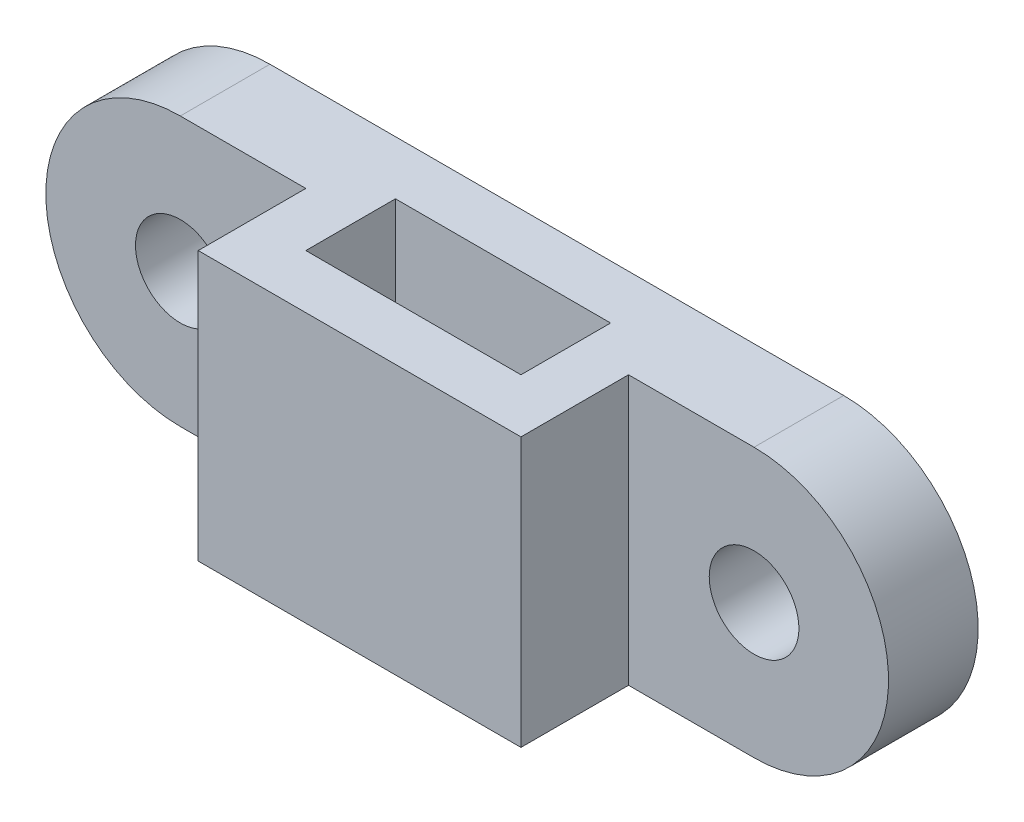
ISO-10303-21;
HEADER;
FILE_DESCRIPTION(('STEP AP214'),'2;1');
FILE_NAME('part.step','',(''),(''),'','','');
FILE_SCHEMA(('AUTOMOTIVE_DESIGN { 1 0 10303 214 1 1 1 1 }'));
ENDSEC;
DATA;
#1=APPLICATION_CONTEXT('core data for automotive mechanical design processes');
#2=APPLICATION_PROTOCOL_DEFINITION('international standard','automotive_design',2000,#1);
#3=PRODUCT_CONTEXT('',#1,'mechanical');
#4=PRODUCT('Part','Part','',(#3));
#5=PRODUCT_RELATED_PRODUCT_CATEGORY('part','',(#4));
#6=PRODUCT_DEFINITION_FORMATION('','',#4);
#7=PRODUCT_DEFINITION_CONTEXT('part definition',#1,'design');
#8=PRODUCT_DEFINITION('design','',#6,#7);
#9=PRODUCT_DEFINITION_SHAPE('','',#8);
#10=(LENGTH_UNIT() NAMED_UNIT(*) SI_UNIT(.MILLI.,.METRE.));
#11=(NAMED_UNIT(*) PLANE_ANGLE_UNIT() SI_UNIT($,.RADIAN.));
#12=(NAMED_UNIT(*) SI_UNIT($,.STERADIAN.) SOLID_ANGLE_UNIT());
#13=UNCERTAINTY_MEASURE_WITH_UNIT(LENGTH_MEASURE(1.E-05),#10,'distance_accuracy_value','');
#14=(GEOMETRIC_REPRESENTATION_CONTEXT(3) GLOBAL_UNCERTAINTY_ASSIGNED_CONTEXT((#13)) GLOBAL_UNIT_ASSIGNED_CONTEXT((#10,
#11,#12)) REPRESENTATION_CONTEXT('',''));
#15=CARTESIAN_POINT('',(0.,0.,0.));
#16=DIRECTION('',(0.,0.,1.));
#17=DIRECTION('',(1.,0.,0.));
#18=AXIS2_PLACEMENT_3D('',#15,#16,#17);
#19=CARTESIAN_POINT('',(12.,15.,0.));
#20=DIRECTION('',(-1.,0.,0.));
#21=DIRECTION('',(0.,0.,1.));
#22=AXIS2_PLACEMENT_3D('',#19,#20,#21);
#23=PLANE('',#22);
#24=DIRECTION('',(0.,-1.,0.));
#25=VECTOR('',#24,1.);
#26=CARTESIAN_POINT('',(12.,15.,0.));
#27=LINE('',#26,#25);
#28=CARTESIAN_POINT('',(12.,15.,0.));
#29=VERTEX_POINT('',#28);
#30=CARTESIAN_POINT('',(12.,7.,0.));
#31=VERTEX_POINT('',#30);
#32=EDGE_CURVE('E291',#29,#31,#27,.T.);
#33=ORIENTED_EDGE('',*,*,#32,.T.);
#34=DIRECTION('',(0.,0.,1.));
#35=VECTOR('',#34,1.);
#36=CARTESIAN_POINT('',(12.,7.,2.82842712474619));
#37=LINE('',#36,#35);
#38=CARTESIAN_POINT('',(12.,7.,2.82842712474619));
#39=VERTEX_POINT('',#38);
#40=EDGE_CURVE('E64',#31,#39,#37,.T.);
#41=ORIENTED_EDGE('',*,*,#40,.T.);
#42=DIRECTION('',(0.,-1.,0.));
#43=VECTOR('',#42,1.);
#44=CARTESIAN_POINT('',(12.,7.,2.82842712474619));
#45=LINE('',#44,#43);
#46=CARTESIAN_POINT('',(12.,5.,2.82842712474619));
#47=VERTEX_POINT('',#46);
#48=EDGE_CURVE('E203',#39,#47,#45,.T.);
#49=ORIENTED_EDGE('',*,*,#48,.T.);
#50=DIRECTION('',(0.,0.,1.));
#51=VECTOR('',#50,1.);
#52=CARTESIAN_POINT('',(12.,5.,2.82842712474619));
#53=LINE('',#52,#51);
#54=CARTESIAN_POINT('',(12.,5.,0.));
#55=VERTEX_POINT('',#54);
#56=EDGE_CURVE('E206',#55,#47,#53,.T.);
#57=ORIENTED_EDGE('',*,*,#56,.F.);
#58=CARTESIAN_POINT('',(12.,0.,0.));
#59=VERTEX_POINT('',#58);
#60=EDGE_CURVE('E290',#55,#59,#27,.T.);
#61=ORIENTED_EDGE('',*,*,#60,.T.);
#62=DIRECTION('',(0.,0.,-1.));
#63=VECTOR('',#62,1.);
#64=CARTESIAN_POINT('',(12.,0.,0.));
#65=LINE('',#64,#63);
#66=CARTESIAN_POINT('',(12.,0.,5.));
#67=VERTEX_POINT('',#66);
#68=EDGE_CURVE('E283',#67,#59,#65,.T.);
#69=ORIENTED_EDGE('',*,*,#68,.F.);
#70=DIRECTION('',(0.,-1.,0.));
#71=VECTOR('',#70,1.);
#72=CARTESIAN_POINT('',(12.,15.,5.));
#73=LINE('',#72,#71);
#74=CARTESIAN_POINT('',(12.,15.,5.));
#75=VERTEX_POINT('',#74);
#76=EDGE_CURVE('E293',#75,#67,#73,.T.);
#77=ORIENTED_EDGE('',*,*,#76,.F.);
#78=DIRECTION('',(0.,0.,-1.));
#79=VECTOR('',#78,1.);
#80=CARTESIAN_POINT('',(12.,15.,0.));
#81=LINE('',#80,#79);
#82=EDGE_CURVE('E272',#75,#29,#81,.T.);
#83=ORIENTED_EDGE('',*,*,#82,.T.);
#84=EDGE_LOOP('',(#33,#41,#49,#57,#61,#69,#77,#83));
#85=FACE_BOUND('',#84,.T.);
#86=ADVANCED_FACE('F41',(#85),#23,.T.);
#87=CARTESIAN_POINT('',(0.,15.,0.));
#88=DIRECTION('',(0.,0.,1.));
#89=DIRECTION('',(1.,0.,0.));
#90=AXIS2_PLACEMENT_3D('',#87,#88,#89);
#91=PLANE('',#90);
#92=DIRECTION('',(0.,-1.,0.));
#93=VECTOR('',#92,1.);
#94=CARTESIAN_POINT('',(9.17157287525381,7.,0.));
#95=LINE('',#94,#93);
#96=CARTESIAN_POINT('',(9.17157287525381,7.,0.));
#97=VERTEX_POINT('',#96);
#98=CARTESIAN_POINT('',(9.17157287525381,5.,0.));
#99=VERTEX_POINT('',#98);
#100=EDGE_CURVE('E211',#97,#99,#95,.T.);
#101=ORIENTED_EDGE('',*,*,#100,.F.);
#102=DIRECTION('',(1.,0.,0.));
#103=VECTOR('',#102,1.);
#104=CARTESIAN_POINT('',(12.,7.,0.));
#105=LINE('',#104,#103);
#106=EDGE_CURVE('E196',#97,#31,#105,.T.);
#107=ORIENTED_EDGE('',*,*,#106,.T.);
#108=ORIENTED_EDGE('',*,*,#32,.F.);
#109=DIRECTION('',(-1.,0.,0.));
#110=VECTOR('',#109,1.);
#111=CARTESIAN_POINT('',(0.,15.,0.));
#112=LINE('',#111,#110);
#113=CARTESIAN_POINT('',(0.,15.,0.));
#114=VERTEX_POINT('',#113);
#115=EDGE_CURVE('E275',#29,#114,#112,.T.);
#116=ORIENTED_EDGE('',*,*,#115,.T.);
#117=DIRECTION('',(0.,-1.,0.));
#118=VECTOR('',#117,1.);
#119=CARTESIAN_POINT('',(0.,15.,0.));
#120=LINE('',#119,#118);
#121=CARTESIAN_POINT('',(0.,0.,0.));
#122=VERTEX_POINT('',#121);
#123=EDGE_CURVE('E277',#114,#122,#120,.T.);
#124=ORIENTED_EDGE('',*,*,#123,.T.);
#125=DIRECTION('',(-1.,0.,0.));
#126=VECTOR('',#125,1.);
#127=CARTESIAN_POINT('',(0.,0.,0.));
#128=LINE('',#127,#126);
#129=EDGE_CURVE('E270',#59,#122,#128,.T.);
#130=ORIENTED_EDGE('',*,*,#129,.F.);
#131=ORIENTED_EDGE('',*,*,#60,.F.);
#132=DIRECTION('',(1.,0.,0.));
#133=VECTOR('',#132,1.);
#134=CARTESIAN_POINT('',(12.,5.,0.));
#135=LINE('',#134,#133);
#136=EDGE_CURVE('E173',#99,#55,#135,.T.);
#137=ORIENTED_EDGE('',*,*,#136,.F.);
#138=EDGE_LOOP('',(#101,#107,#108,#116,#124,#130,#131,#137));
#139=FACE_BOUND('',#138,.T.);
#140=ADVANCED_FACE('F375',(#139),#91,.T.);
#141=CARTESIAN_POINT('',(15.,15.,-3.));
#142=DIRECTION('',(-1.,0.,0.));
#143=DIRECTION('',(0.,0.,1.));
#144=AXIS2_PLACEMENT_3D('',#141,#142,#143);
#145=PLANE('',#144);
#146=DIRECTION('',(0.,-1.,0.));
#147=VECTOR('',#146,1.);
#148=CARTESIAN_POINT('',(15.,0.,2.));
#149=LINE('',#148,#147);
#150=CARTESIAN_POINT('',(15.,15.,2.));
#151=VERTEX_POINT('',#150);
#152=CARTESIAN_POINT('',(15.,0.,2.));
#153=VERTEX_POINT('',#152);
#154=EDGE_CURVE('E228',#151,#153,#149,.T.);
#155=ORIENTED_EDGE('',*,*,#154,.F.);
#156=DIRECTION('',(0.,0.,-1.));
#157=VECTOR('',#156,1.);
#158=CARTESIAN_POINT('',(15.,15.,-3.));
#159=LINE('',#158,#157);
#160=CARTESIAN_POINT('',(15.,15.,8.));
#161=VERTEX_POINT('',#160);
#162=EDGE_CURVE('E304',#161,#151,#159,.T.);
#163=ORIENTED_EDGE('',*,*,#162,.F.);
#164=DIRECTION('',(0.,-1.,0.));
#165=VECTOR('',#164,1.);
#166=CARTESIAN_POINT('',(15.,15.,8.));
#167=LINE('',#166,#165);
#168=CARTESIAN_POINT('',(15.,0.,8.));
#169=VERTEX_POINT('',#168);
#170=EDGE_CURVE('E49',#161,#169,#167,.T.);
#171=ORIENTED_EDGE('',*,*,#170,.T.);
#172=DIRECTION('',(0.,0.,-1.));
#173=VECTOR('',#172,1.);
#174=CARTESIAN_POINT('',(15.,0.,-3.));
#175=LINE('',#174,#173);
#176=EDGE_CURVE('E312',#169,#153,#175,.T.);
#177=ORIENTED_EDGE('',*,*,#176,.T.);
#178=EDGE_LOOP('',(#155,#163,#171,#177));
#179=FACE_BOUND('',#178,.T.);
#180=ADVANCED_FACE('F319',(#179),#145,.F.);
#181=CARTESIAN_POINT('',(-3.,15.,-3.));
#182=DIRECTION('',(1.,0.,0.));
#183=DIRECTION('',(0.,0.,-1.));
#184=AXIS2_PLACEMENT_3D('',#181,#182,#183);
#185=PLANE('',#184);
#186=DIRECTION('',(0.,1.,0.));
#187=VECTOR('',#186,1.);
#188=CARTESIAN_POINT('',(-3.,0.,2.));
#189=LINE('',#188,#187);
#190=CARTESIAN_POINT('',(-3.,0.,2.));
#191=VERTEX_POINT('',#190);
#192=CARTESIAN_POINT('',(-3.,15.,2.));
#193=VERTEX_POINT('',#192);
#194=EDGE_CURVE('E250',#191,#193,#189,.T.);
#195=ORIENTED_EDGE('',*,*,#194,.F.);
#196=DIRECTION('',(0.,0.,1.));
#197=VECTOR('',#196,1.);
#198=CARTESIAN_POINT('',(-3.,0.,-3.));
#199=LINE('',#198,#197);
#200=CARTESIAN_POINT('',(-3.,0.,8.));
#201=VERTEX_POINT('',#200);
#202=EDGE_CURVE('E298',#191,#201,#199,.T.);
#203=ORIENTED_EDGE('',*,*,#202,.T.);
#204=DIRECTION('',(0.,-1.,0.));
#205=VECTOR('',#204,1.);
#206=CARTESIAN_POINT('',(-3.,15.,8.));
#207=LINE('',#206,#205);
#208=CARTESIAN_POINT('',(-3.,15.,8.));
#209=VERTEX_POINT('',#208);
#210=EDGE_CURVE('E11',#209,#201,#207,.T.);
#211=ORIENTED_EDGE('',*,*,#210,.F.);
#212=DIRECTION('',(0.,0.,1.));
#213=VECTOR('',#212,1.);
#214=CARTESIAN_POINT('',(-3.,15.,-3.));
#215=LINE('',#214,#213);
#216=EDGE_CURVE('E299',#193,#209,#215,.T.);
#217=ORIENTED_EDGE('',*,*,#216,.F.);
#218=EDGE_LOOP('',(#195,#203,#211,#217));
#219=FACE_BOUND('',#218,.T.);
#220=ADVANCED_FACE('F43',(#219),#185,.F.);
#221=CARTESIAN_POINT('',(0.,15.,0.));
#222=DIRECTION('',(0.,1.,0.));
#223=DIRECTION('',(0.,0.,1.));
#224=AXIS2_PLACEMENT_3D('',#221,#222,#223);
#225=PLANE('',#224);
#226=DIRECTION('',(-1.,0.,0.));
#227=VECTOR('',#226,1.);
#228=CARTESIAN_POINT('',(-3.,15.,-3.));
#229=LINE('',#228,#227);
#230=CARTESIAN_POINT('',(22.,15.,-3.));
#231=VERTEX_POINT('',#230);
#232=CARTESIAN_POINT('',(-10.,15.,-3.));
#233=VERTEX_POINT('',#232);
#234=EDGE_CURVE('E307',#231,#233,#229,.T.);
#235=ORIENTED_EDGE('',*,*,#234,.T.);
#236=DIRECTION('',(0.,0.,-1.));
#237=VECTOR('',#236,1.);
#238=CARTESIAN_POINT('',(-10.,15.,2.));
#239=LINE('',#238,#237);
#240=CARTESIAN_POINT('',(-10.,15.,2.));
#241=VERTEX_POINT('',#240);
#242=EDGE_CURVE('E256',#241,#233,#239,.T.);
#243=ORIENTED_EDGE('',*,*,#242,.F.);
#244=DIRECTION('',(-1.,0.,0.));
#245=VECTOR('',#244,1.);
#246=CARTESIAN_POINT('',(0.,15.,2.));
#247=LINE('',#246,#245);
#248=EDGE_CURVE('E248',#193,#241,#247,.T.);
#249=ORIENTED_EDGE('',*,*,#248,.F.);
#250=ORIENTED_EDGE('',*,*,#216,.T.);
#251=DIRECTION('',(1.,0.,0.));
#252=VECTOR('',#251,1.);
#253=CARTESIAN_POINT('',(-3.,15.,8.));
#254=LINE('',#253,#252);
#255=EDGE_CURVE('E301',#209,#161,#254,.T.);
#256=ORIENTED_EDGE('',*,*,#255,.T.);
#257=ORIENTED_EDGE('',*,*,#162,.T.);
#258=DIRECTION('',(1.,0.,0.));
#259=VECTOR('',#258,1.);
#260=CARTESIAN_POINT('',(0.,15.,2.));
#261=LINE('',#260,#259);
#262=CARTESIAN_POINT('',(22.,15.,2.));
#263=VERTEX_POINT('',#262);
#264=EDGE_CURVE('E219',#151,#263,#261,.T.);
#265=ORIENTED_EDGE('',*,*,#264,.T.);
#266=DIRECTION('',(0.,0.,-1.));
#267=VECTOR('',#266,1.);
#268=CARTESIAN_POINT('',(22.,15.,2.));
#269=LINE('',#268,#267);
#270=EDGE_CURVE('E231',#263,#231,#269,.T.);
#271=ORIENTED_EDGE('',*,*,#270,.T.);
#272=EDGE_LOOP('',(#235,#243,#249,#250,#256,#257,#265,#271));
#273=FACE_BOUND('',#272,.T.);
#274=DIRECTION('',(1.,0.,0.));
#275=VECTOR('',#274,1.);
#276=CARTESIAN_POINT('',(0.,15.,5.));
#277=LINE('',#276,#275);
#278=CARTESIAN_POINT('',(0.,15.,5.));
#279=VERTEX_POINT('',#278);
#280=EDGE_CURVE('E269',#279,#75,#277,.T.);
#281=ORIENTED_EDGE('',*,*,#280,.F.);
#282=DIRECTION('',(0.,0.,1.));
#283=VECTOR('',#282,1.);
#284=CARTESIAN_POINT('',(0.,15.,0.));
#285=LINE('',#284,#283);
#286=EDGE_CURVE('E267',#114,#279,#285,.T.);
#287=ORIENTED_EDGE('',*,*,#286,.F.);
#288=ORIENTED_EDGE('',*,*,#115,.F.);
#289=ORIENTED_EDGE('',*,*,#82,.F.);
#290=EDGE_LOOP('',(#281,#287,#288,#289));
#291=FACE_BOUND('',#290,.T.);
#292=ADVANCED_FACE('F334',(#273,#291),#225,.T.);
#293=CARTESIAN_POINT('',(0.,0.,0.));
#294=DIRECTION('',(0.,1.,0.));
#295=DIRECTION('',(0.,0.,1.));
#296=AXIS2_PLACEMENT_3D('',#293,#294,#295);
#297=PLANE('',#296);
#298=ORIENTED_EDGE('',*,*,#202,.F.);
#299=DIRECTION('',(-1.,0.,0.));
#300=VECTOR('',#299,1.);
#301=CARTESIAN_POINT('',(0.,0.,2.));
#302=LINE('',#301,#300);
#303=CARTESIAN_POINT('',(-10.,0.,2.));
#304=VERTEX_POINT('',#303);
#305=EDGE_CURVE('E253',#191,#304,#302,.T.);
#306=ORIENTED_EDGE('',*,*,#305,.T.);
#307=DIRECTION('',(0.,0.,-1.));
#308=VECTOR('',#307,1.);
#309=CARTESIAN_POINT('',(-10.,0.,2.));
#310=LINE('',#309,#308);
#311=CARTESIAN_POINT('',(-10.,0.,-3.));
#312=VERTEX_POINT('',#311);
#313=EDGE_CURVE('E261',#304,#312,#310,.T.);
#314=ORIENTED_EDGE('',*,*,#313,.T.);
#315=DIRECTION('',(-1.,0.,0.));
#316=VECTOR('',#315,1.);
#317=CARTESIAN_POINT('',(-3.,0.,-3.));
#318=LINE('',#317,#316);
#319=CARTESIAN_POINT('',(22.,0.,-3.));
#320=VERTEX_POINT('',#319);
#321=EDGE_CURVE('E302',#320,#312,#318,.T.);
#322=ORIENTED_EDGE('',*,*,#321,.F.);
#323=DIRECTION('',(0.,0.,-1.));
#324=VECTOR('',#323,1.);
#325=CARTESIAN_POINT('',(22.,0.,2.));
#326=LINE('',#325,#324);
#327=CARTESIAN_POINT('',(22.,0.,2.));
#328=VERTEX_POINT('',#327);
#329=EDGE_CURVE('E236',#328,#320,#326,.T.);
#330=ORIENTED_EDGE('',*,*,#329,.F.);
#331=DIRECTION('',(1.,0.,0.));
#332=VECTOR('',#331,1.);
#333=CARTESIAN_POINT('',(0.,0.,2.));
#334=LINE('',#333,#332);
#335=EDGE_CURVE('E226',#153,#328,#334,.T.);
#336=ORIENTED_EDGE('',*,*,#335,.F.);
#337=ORIENTED_EDGE('',*,*,#176,.F.);
#338=DIRECTION('',(1.,0.,0.));
#339=VECTOR('',#338,1.);
#340=CARTESIAN_POINT('',(-3.,0.,8.));
#341=LINE('',#340,#339);
#342=EDGE_CURVE('E310',#201,#169,#341,.T.);
#343=ORIENTED_EDGE('',*,*,#342,.F.);
#344=EDGE_LOOP('',(#298,#306,#314,#322,#330,#336,#337,#343));
#345=FACE_BOUND('',#344,.T.);
#346=DIRECTION('',(0.,0.,1.));
#347=VECTOR('',#346,1.);
#348=CARTESIAN_POINT('',(0.,0.,0.));
#349=LINE('',#348,#347);
#350=CARTESIAN_POINT('',(0.,0.,5.));
#351=VERTEX_POINT('',#350);
#352=EDGE_CURVE('E264',#122,#351,#349,.T.);
#353=ORIENTED_EDGE('',*,*,#352,.T.);
#354=DIRECTION('',(1.,0.,0.));
#355=VECTOR('',#354,1.);
#356=CARTESIAN_POINT('',(0.,0.,5.));
#357=LINE('',#356,#355);
#358=EDGE_CURVE('E280',#351,#67,#357,.T.);
#359=ORIENTED_EDGE('',*,*,#358,.T.);
#360=ORIENTED_EDGE('',*,*,#68,.T.);
#361=ORIENTED_EDGE('',*,*,#129,.T.);
#362=EDGE_LOOP('',(#353,#359,#360,#361));
#363=FACE_BOUND('',#362,.T.);
#364=ADVANCED_FACE('F326',(#345,#363),#297,.F.);
#365=CARTESIAN_POINT('',(-3.,15.,8.));
#366=DIRECTION('',(0.,0.,-1.));
#367=DIRECTION('',(-1.,0.,0.));
#368=AXIS2_PLACEMENT_3D('',#365,#366,#367);
#369=PLANE('',#368);
#370=ORIENTED_EDGE('',*,*,#342,.T.);
#371=ORIENTED_EDGE('',*,*,#170,.F.);
#372=ORIENTED_EDGE('',*,*,#255,.F.);
#373=ORIENTED_EDGE('',*,*,#210,.T.);
#374=EDGE_LOOP('',(#370,#371,#372,#373));
#375=FACE_BOUND('',#374,.T.);
#376=ADVANCED_FACE('F338',(#375),#369,.F.);
#377=CARTESIAN_POINT('',(-3.,15.,-3.));
#378=DIRECTION('',(0.,0.,1.));
#379=DIRECTION('',(1.,0.,0.));
#380=AXIS2_PLACEMENT_3D('',#377,#378,#379);
#381=PLANE('',#380);
#382=ORIENTED_EDGE('',*,*,#321,.T.);
#383=CARTESIAN_POINT('',(-10.,7.5,-3.));
#384=DIRECTION('',(0.,0.,-1.));
#385=DIRECTION('',(-1.,0.,0.));
#386=AXIS2_PLACEMENT_3D('',#383,#384,#385);
#387=CIRCLE('',#386,7.5);
#388=EDGE_CURVE('E246',#233,#312,#387,.F.);
#389=ORIENTED_EDGE('',*,*,#388,.F.);
#390=ORIENTED_EDGE('',*,*,#234,.F.);
#391=CARTESIAN_POINT('',(22.,7.5,-3.));
#392=DIRECTION('',(0.,0.,-1.));
#393=DIRECTION('',(-1.,0.,0.));
#394=AXIS2_PLACEMENT_3D('',#391,#392,#393);
#395=CIRCLE('',#394,7.5);
#396=EDGE_CURVE('E220',#231,#320,#395,.T.);
#397=ORIENTED_EDGE('',*,*,#396,.T.);
#398=EDGE_LOOP('',(#382,#389,#390,#397));
#399=FACE_BOUND('',#398,.T.);
#400=CARTESIAN_POINT('',(-10.,7.5,-3.));
#401=DIRECTION('',(0.,0.,-1.));
#402=DIRECTION('',(-1.,0.,0.));
#403=AXIS2_PLACEMENT_3D('',#400,#401,#402);
#404=CIRCLE('',#403,2.5);
#405=CARTESIAN_POINT('',(-12.5,7.5,-3.));
#406=VERTEX_POINT('',#405);
#407=EDGE_CURVE('E239',#406,#406,#404,.T.);
#408=ORIENTED_EDGE('',*,*,#407,.F.);
#409=EDGE_LOOP('',(#408));
#410=FACE_BOUND('',#409,.T.);
#411=CARTESIAN_POINT('',(22.,7.5,-3.));
#412=DIRECTION('',(0.,0.,-1.));
#413=DIRECTION('',(-1.,0.,0.));
#414=AXIS2_PLACEMENT_3D('',#411,#412,#413);
#415=CIRCLE('',#414,2.5);
#416=CARTESIAN_POINT('',(19.5,7.5,-3.));
#417=VERTEX_POINT('',#416);
#418=EDGE_CURVE('E214',#417,#417,#415,.T.);
#419=ORIENTED_EDGE('',*,*,#418,.F.);
#420=EDGE_LOOP('',(#419));
#421=FACE_BOUND('',#420,.T.);
#422=ADVANCED_FACE('F353',(#399,#410,#421),#381,.F.);
#423=CARTESIAN_POINT('',(0.,15.,0.));
#424=DIRECTION('',(1.,0.,0.));
#425=DIRECTION('',(0.,0.,-1.));
#426=AXIS2_PLACEMENT_3D('',#423,#424,#425);
#427=PLANE('',#426);
#428=DIRECTION('',(0.,0.,-1.));
#429=VECTOR('',#428,1.);
#430=CARTESIAN_POINT('',(0.,7.,2.17157287525381));
#431=LINE('',#430,#429);
#432=CARTESIAN_POINT('',(0.,7.,5.));
#433=VERTEX_POINT('',#432);
#434=CARTESIAN_POINT('',(0.,7.,2.17157287525381));
#435=VERTEX_POINT('',#434);
#436=EDGE_CURVE('E186',#433,#435,#431,.T.);
#437=ORIENTED_EDGE('',*,*,#436,.T.);
#438=DIRECTION('',(0.,-1.,0.));
#439=VECTOR('',#438,1.);
#440=CARTESIAN_POINT('',(0.,7.,2.17157287525381));
#441=LINE('',#440,#439);
#442=CARTESIAN_POINT('',(0.,5.,2.17157287525381));
#443=VERTEX_POINT('',#442);
#444=EDGE_CURVE('E168',#435,#443,#441,.T.);
#445=ORIENTED_EDGE('',*,*,#444,.T.);
#446=DIRECTION('',(0.,0.,-1.));
#447=VECTOR('',#446,1.);
#448=CARTESIAN_POINT('',(0.,5.,2.17157287525381));
#449=LINE('',#448,#447);
#450=CARTESIAN_POINT('',(0.,5.,5.));
#451=VERTEX_POINT('',#450);
#452=EDGE_CURVE('E177',#451,#443,#449,.T.);
#453=ORIENTED_EDGE('',*,*,#452,.F.);
#454=DIRECTION('',(0.,-1.,0.));
#455=VECTOR('',#454,1.);
#456=CARTESIAN_POINT('',(0.,15.,5.));
#457=LINE('',#456,#455);
#458=EDGE_CURVE('E295',#451,#351,#457,.T.);
#459=ORIENTED_EDGE('',*,*,#458,.T.);
#460=ORIENTED_EDGE('',*,*,#352,.F.);
#461=ORIENTED_EDGE('',*,*,#123,.F.);
#462=ORIENTED_EDGE('',*,*,#286,.T.);
#463=EDGE_CURVE('E296',#279,#433,#457,.T.);
#464=ORIENTED_EDGE('',*,*,#463,.T.);
#465=EDGE_LOOP('',(#437,#445,#453,#459,#460,#461,#462,#464));
#466=FACE_BOUND('',#465,.T.);
#467=ADVANCED_FACE('F184',(#466),#427,.T.);
#468=CARTESIAN_POINT('',(0.,15.,5.));
#469=DIRECTION('',(0.,0.,-1.));
#470=DIRECTION('',(-1.,0.,0.));
#471=AXIS2_PLACEMENT_3D('',#468,#469,#470);
#472=PLANE('',#471);
#473=DIRECTION('',(-1.,0.,0.));
#474=VECTOR('',#473,1.);
#475=CARTESIAN_POINT('',(0.,7.,5.));
#476=LINE('',#475,#474);
#477=CARTESIAN_POINT('',(2.82842712474619,7.,5.));
#478=VERTEX_POINT('',#477);
#479=EDGE_CURVE('E192',#478,#433,#476,.T.);
#480=ORIENTED_EDGE('',*,*,#479,.T.);
#481=ORIENTED_EDGE('',*,*,#463,.F.);
#482=ORIENTED_EDGE('',*,*,#280,.T.);
#483=ORIENTED_EDGE('',*,*,#76,.T.);
#484=ORIENTED_EDGE('',*,*,#358,.F.);
#485=ORIENTED_EDGE('',*,*,#458,.F.);
#486=DIRECTION('',(-1.,0.,0.));
#487=VECTOR('',#486,1.);
#488=CARTESIAN_POINT('',(0.,5.,5.));
#489=LINE('',#488,#487);
#490=CARTESIAN_POINT('',(2.82842712474619,5.,5.));
#491=VERTEX_POINT('',#490);
#492=EDGE_CURVE('E174',#491,#451,#489,.T.);
#493=ORIENTED_EDGE('',*,*,#492,.F.);
#494=DIRECTION('',(0.,-1.,0.));
#495=VECTOR('',#494,1.);
#496=CARTESIAN_POINT('',(2.82842712474619,7.,5.));
#497=LINE('',#496,#495);
#498=EDGE_CURVE('E171',#478,#491,#497,.T.);
#499=ORIENTED_EDGE('',*,*,#498,.F.);
#500=EDGE_LOOP('',(#480,#481,#482,#483,#484,#485,#493,#499));
#501=FACE_BOUND('',#500,.T.);
#502=ADVANCED_FACE('F385',(#501),#472,.T.);
#503=CARTESIAN_POINT('',(-10.,7.5,2.));
#504=DIRECTION('',(0.,0.,-1.));
#505=DIRECTION('',(-1.,0.,0.));
#506=AXIS2_PLACEMENT_3D('',#503,#504,#505);
#507=CYLINDRICAL_SURFACE('',#506,7.5);
#508=ORIENTED_EDGE('',*,*,#388,.T.);
#509=ORIENTED_EDGE('',*,*,#313,.F.);
#510=CARTESIAN_POINT('',(-10.,7.5,2.));
#511=DIRECTION('',(0.,0.,-1.));
#512=DIRECTION('',(-1.,0.,0.));
#513=AXIS2_PLACEMENT_3D('',#510,#511,#512);
#514=CIRCLE('',#513,7.5);
#515=EDGE_CURVE('E245',#241,#304,#514,.F.);
#516=ORIENTED_EDGE('',*,*,#515,.F.);
#517=ORIENTED_EDGE('',*,*,#242,.T.);
#518=EDGE_LOOP('',(#508,#509,#516,#517));
#519=FACE_BOUND('',#518,.T.);
#520=ADVANCED_FACE('F347',(#519),#507,.T.);
#521=CARTESIAN_POINT('',(-10.,7.5,2.));
#522=DIRECTION('',(0.,0.,-1.));
#523=DIRECTION('',(-1.,0.,0.));
#524=AXIS2_PLACEMENT_3D('',#521,#522,#523);
#525=CYLINDRICAL_SURFACE('',#524,2.5);
#526=CARTESIAN_POINT('',(-10.,7.5,2.));
#527=DIRECTION('',(0.,0.,-1.));
#528=DIRECTION('',(-1.,0.,0.));
#529=AXIS2_PLACEMENT_3D('',#526,#527,#528);
#530=CIRCLE('',#529,2.5);
#531=CARTESIAN_POINT('',(-12.5,7.5,2.));
#532=VERTEX_POINT('',#531);
#533=EDGE_CURVE('E242',#532,#532,#530,.T.);
#534=ORIENTED_EDGE('',*,*,#533,.F.);
#535=EDGE_LOOP('',(#534));
#536=FACE_BOUND('',#535,.T.);
#537=ORIENTED_EDGE('',*,*,#407,.T.);
#538=EDGE_LOOP('',(#537));
#539=FACE_BOUND('',#538,.T.);
#540=ADVANCED_FACE('F370',(#536,#539),#525,.F.);
#541=CARTESIAN_POINT('',(0.,0.,2.));
#542=DIRECTION('',(0.,0.,-1.));
#543=DIRECTION('',(-1.,0.,0.));
#544=AXIS2_PLACEMENT_3D('',#541,#542,#543);
#545=PLANE('',#544);
#546=ORIENTED_EDGE('',*,*,#533,.T.);
#547=EDGE_LOOP('',(#546));
#548=FACE_BOUND('',#547,.T.);
#549=ORIENTED_EDGE('',*,*,#515,.T.);
#550=ORIENTED_EDGE('',*,*,#305,.F.);
#551=ORIENTED_EDGE('',*,*,#194,.T.);
#552=ORIENTED_EDGE('',*,*,#248,.T.);
#553=EDGE_LOOP('',(#549,#550,#551,#552));
#554=FACE_BOUND('',#553,.T.);
#555=ADVANCED_FACE('F342',(#548,#554),#545,.F.);
#556=CARTESIAN_POINT('',(22.,7.5,2.));
#557=DIRECTION('',(0.,0.,-1.));
#558=DIRECTION('',(-1.,0.,0.));
#559=AXIS2_PLACEMENT_3D('',#556,#557,#558);
#560=CYLINDRICAL_SURFACE('',#559,2.5);
#561=CARTESIAN_POINT('',(22.,7.5,2.));
#562=DIRECTION('',(0.,0.,-1.));
#563=DIRECTION('',(-1.,0.,0.));
#564=AXIS2_PLACEMENT_3D('',#561,#562,#563);
#565=CIRCLE('',#564,2.5);
#566=CARTESIAN_POINT('',(19.5,7.5,2.));
#567=VERTEX_POINT('',#566);
#568=EDGE_CURVE('E216',#567,#567,#565,.T.);
#569=ORIENTED_EDGE('',*,*,#568,.F.);
#570=EDGE_LOOP('',(#569));
#571=FACE_BOUND('',#570,.T.);
#572=ORIENTED_EDGE('',*,*,#418,.T.);
#573=EDGE_LOOP('',(#572));
#574=FACE_BOUND('',#573,.T.);
#575=ADVANCED_FACE('F361',(#571,#574),#560,.F.);
#576=CARTESIAN_POINT('',(22.,7.5,2.));
#577=DIRECTION('',(0.,0.,-1.));
#578=DIRECTION('',(-1.,0.,0.));
#579=AXIS2_PLACEMENT_3D('',#576,#577,#578);
#580=CYLINDRICAL_SURFACE('',#579,7.5);
#581=ORIENTED_EDGE('',*,*,#396,.F.);
#582=ORIENTED_EDGE('',*,*,#270,.F.);
#583=CARTESIAN_POINT('',(22.,7.5,2.));
#584=DIRECTION('',(0.,0.,-1.));
#585=DIRECTION('',(-1.,0.,0.));
#586=AXIS2_PLACEMENT_3D('',#583,#584,#585);
#587=CIRCLE('',#586,7.5);
#588=EDGE_CURVE('E223',#263,#328,#587,.T.);
#589=ORIENTED_EDGE('',*,*,#588,.T.);
#590=ORIENTED_EDGE('',*,*,#329,.T.);
#591=EDGE_LOOP('',(#581,#582,#589,#590));
#592=FACE_BOUND('',#591,.T.);
#593=ADVANCED_FACE('F352',(#592),#580,.T.);
#594=CARTESIAN_POINT('',(0.,0.,2.));
#595=DIRECTION('',(0.,0.,-1.));
#596=DIRECTION('',(-1.,0.,0.));
#597=AXIS2_PLACEMENT_3D('',#594,#595,#596);
#598=PLANE('',#597);
#599=ORIENTED_EDGE('',*,*,#568,.T.);
#600=EDGE_LOOP('',(#599));
#601=FACE_BOUND('',#600,.T.);
#602=ORIENTED_EDGE('',*,*,#264,.F.);
#603=ORIENTED_EDGE('',*,*,#154,.T.);
#604=ORIENTED_EDGE('',*,*,#335,.T.);
#605=ORIENTED_EDGE('',*,*,#588,.F.);
#606=EDGE_LOOP('',(#602,#603,#604,#605));
#607=FACE_BOUND('',#606,.T.);
#608=ADVANCED_FACE('F332',(#601,#607),#598,.F.);
#609=CARTESIAN_POINT('',(9.17157287525381,7.,0.));
#610=DIRECTION('',(-0.707106781186547,0.,0.707106781186547));
#611=DIRECTION('',(0.707106781186548,0.,0.707106781186548));
#612=AXIS2_PLACEMENT_3D('',#609,#610,#611);
#613=PLANE('',#612);
#614=DIRECTION('',(-0.707106781186547,0.,-0.707106781186547));
#615=VECTOR('',#614,1.);
#616=CARTESIAN_POINT('',(9.17157287525381,5.,0.));
#617=LINE('',#616,#615);
#618=EDGE_CURVE('E198',#47,#99,#617,.T.);
#619=ORIENTED_EDGE('',*,*,#618,.F.);
#620=ORIENTED_EDGE('',*,*,#48,.F.);
#621=DIRECTION('',(-0.707106781186547,0.,-0.707106781186547));
#622=VECTOR('',#621,1.);
#623=CARTESIAN_POINT('',(9.17157287525381,7.,0.));
#624=LINE('',#623,#622);
#625=EDGE_CURVE('E200',#39,#97,#624,.T.);
#626=ORIENTED_EDGE('',*,*,#625,.T.);
#627=ORIENTED_EDGE('',*,*,#100,.T.);
#628=EDGE_LOOP('',(#619,#620,#626,#627));
#629=FACE_BOUND('',#628,.T.);
#630=ADVANCED_FACE('F465',(#629),#613,.T.);
#631=CARTESIAN_POINT('',(0.,7.,0.));
#632=DIRECTION('',(0.,-1.,0.));
#633=DIRECTION('',(0.,0.,-1.));
#634=AXIS2_PLACEMENT_3D('',#631,#632,#633);
#635=PLANE('',#634);
#636=ORIENTED_EDGE('',*,*,#106,.F.);
#637=ORIENTED_EDGE('',*,*,#625,.F.);
#638=ORIENTED_EDGE('',*,*,#40,.F.);
#639=EDGE_LOOP('',(#636,#637,#638));
#640=FACE_BOUND('',#639,.T.);
#641=ADVANCED_FACE('F484',(#640),#635,.F.);
#642=CARTESIAN_POINT('',(0.,5.,0.));
#643=DIRECTION('',(0.,-1.,0.));
#644=DIRECTION('',(0.,0.,-1.));
#645=AXIS2_PLACEMENT_3D('',#642,#643,#644);
#646=PLANE('',#645);
#647=ORIENTED_EDGE('',*,*,#136,.T.);
#648=ORIENTED_EDGE('',*,*,#56,.T.);
#649=ORIENTED_EDGE('',*,*,#618,.T.);
#650=EDGE_LOOP('',(#647,#648,#649));
#651=FACE_BOUND('',#650,.T.);
#652=ADVANCED_FACE('F494',(#651),#646,.T.);
#653=CARTESIAN_POINT('',(0.,7.,2.17157287525381));
#654=DIRECTION('',(0.707106781186547,0.,-0.707106781186548));
#655=DIRECTION('',(-0.707106781186548,0.,-0.707106781186547));
#656=AXIS2_PLACEMENT_3D('',#653,#654,#655);
#657=PLANE('',#656);
#658=DIRECTION('',(0.707106781186548,0.,0.707106781186547));
#659=VECTOR('',#658,1.);
#660=CARTESIAN_POINT('',(0.,5.,2.17157287525381));
#661=LINE('',#660,#659);
#662=EDGE_CURVE('E56',#443,#491,#661,.T.);
#663=ORIENTED_EDGE('',*,*,#662,.F.);
#664=ORIENTED_EDGE('',*,*,#444,.F.);
#665=DIRECTION('',(0.707106781186548,0.,0.707106781186547));
#666=VECTOR('',#665,1.);
#667=CARTESIAN_POINT('',(0.,7.,2.17157287525381));
#668=LINE('',#667,#666);
#669=EDGE_CURVE('E181',#435,#478,#668,.T.);
#670=ORIENTED_EDGE('',*,*,#669,.T.);
#671=ORIENTED_EDGE('',*,*,#498,.T.);
#672=EDGE_LOOP('',(#663,#664,#670,#671));
#673=FACE_BOUND('',#672,.T.);
#674=ADVANCED_FACE('F165',(#673),#657,.T.);
#675=CARTESIAN_POINT('',(0.,7.,0.));
#676=DIRECTION('',(0.,1.,0.));
#677=DIRECTION('',(0.,0.,1.));
#678=AXIS2_PLACEMENT_3D('',#675,#676,#677);
#679=PLANE('',#678);
#680=ORIENTED_EDGE('',*,*,#669,.F.);
#681=ORIENTED_EDGE('',*,*,#436,.F.);
#682=ORIENTED_EDGE('',*,*,#479,.F.);
#683=EDGE_LOOP('',(#680,#681,#682));
#684=FACE_BOUND('',#683,.T.);
#685=ADVANCED_FACE('F513',(#684),#679,.T.);
#686=CARTESIAN_POINT('',(0.,5.,0.));
#687=DIRECTION('',(0.,1.,0.));
#688=DIRECTION('',(0.,0.,1.));
#689=AXIS2_PLACEMENT_3D('',#686,#687,#688);
#690=PLANE('',#689);
#691=ORIENTED_EDGE('',*,*,#662,.T.);
#692=ORIENTED_EDGE('',*,*,#492,.T.);
#693=ORIENTED_EDGE('',*,*,#452,.T.);
#694=EDGE_LOOP('',(#691,#692,#693));
#695=FACE_BOUND('',#694,.T.);
#696=ADVANCED_FACE('F178',(#695),#690,.F.);
#697=CLOSED_SHELL('',(#86,#140,#180,#220,#292,#364,#376,#422,#467,#502,#520,#540,#555,#575,#593,
#608,#630,#641,#652,#674,#685,#696));
#698=MANIFOLD_SOLID_BREP('B2',#697);
#699=ADVANCED_BREP_SHAPE_REPRESENTATION('',(#18,#698),#14);
#700=SHAPE_DEFINITION_REPRESENTATION(#9,#699);
ENDSEC;
END-ISO-10303-21;
